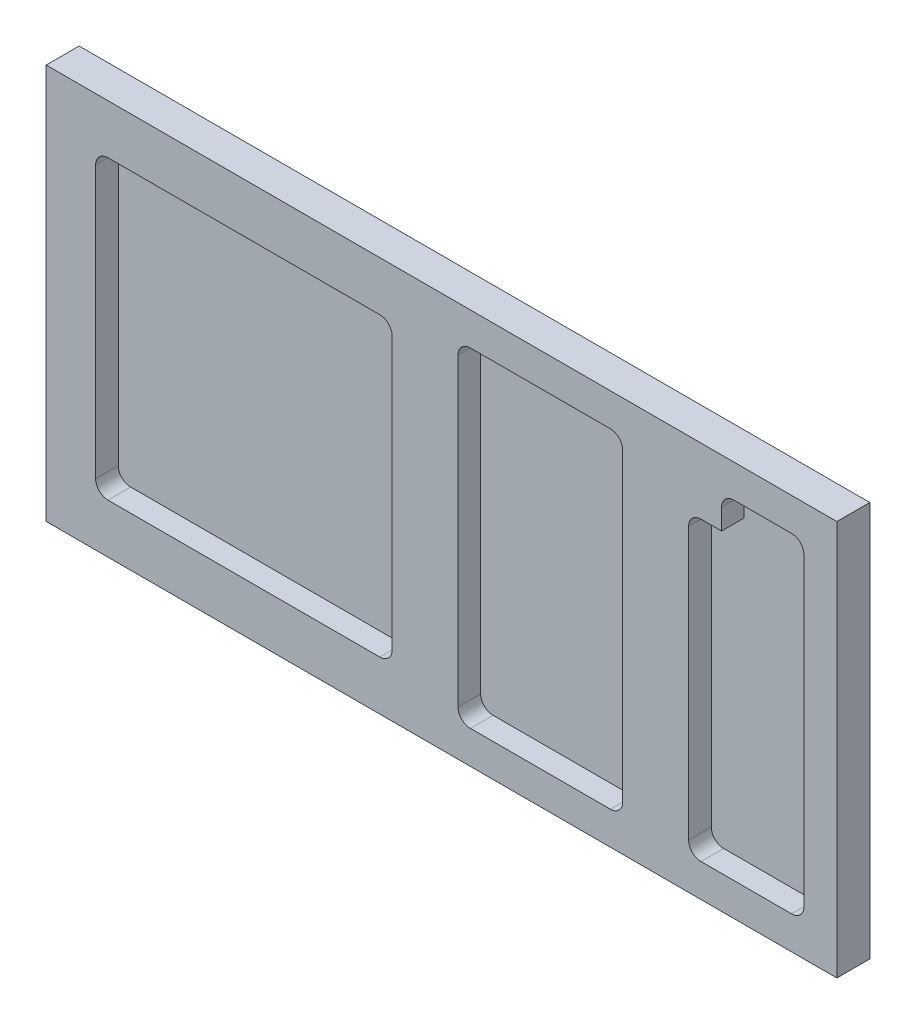
ISO-10303-21;
HEADER;
FILE_DESCRIPTION(('STEP AP214'),'2;1');
FILE_NAME('part.step','',(''),(''),'','','');
FILE_SCHEMA(('AUTOMOTIVE_DESIGN { 1 0 10303 214 1 1 1 1 }'));
ENDSEC;
DATA;
#1=APPLICATION_CONTEXT('core data for automotive mechanical design processes');
#2=APPLICATION_PROTOCOL_DEFINITION('international standard','automotive_design',2000,#1);
#3=PRODUCT_CONTEXT('',#1,'mechanical');
#4=PRODUCT('Part','Part','',(#3));
#5=PRODUCT_RELATED_PRODUCT_CATEGORY('part','',(#4));
#6=PRODUCT_DEFINITION_FORMATION('','',#4);
#7=PRODUCT_DEFINITION_CONTEXT('part definition',#1,'design');
#8=PRODUCT_DEFINITION('design','',#6,#7);
#9=PRODUCT_DEFINITION_SHAPE('','',#8);
#10=(LENGTH_UNIT() NAMED_UNIT(*) SI_UNIT(.MILLI.,.METRE.));
#11=(NAMED_UNIT(*) PLANE_ANGLE_UNIT() SI_UNIT($,.RADIAN.));
#12=(NAMED_UNIT(*) SI_UNIT($,.STERADIAN.) SOLID_ANGLE_UNIT());
#13=UNCERTAINTY_MEASURE_WITH_UNIT(LENGTH_MEASURE(1.E-05),#10,'distance_accuracy_value','');
#14=(GEOMETRIC_REPRESENTATION_CONTEXT(3) GLOBAL_UNCERTAINTY_ASSIGNED_CONTEXT((#13)) GLOBAL_UNIT_ASSIGNED_CONTEXT((#10,
#11,#12)) REPRESENTATION_CONTEXT('',''));
#15=CARTESIAN_POINT('',(0.,0.,0.));
#16=DIRECTION('',(0.,0.,1.));
#17=DIRECTION('',(1.,0.,0.));
#18=AXIS2_PLACEMENT_3D('',#15,#16,#17);
#19=CARTESIAN_POINT('',(152.4,76.2,12.7));
#20=DIRECTION('',(-1.,0.,0.));
#21=DIRECTION('',(0.,-1.,0.));
#22=AXIS2_PLACEMENT_3D('',#19,#20,#21);
#23=PLANE('',#22);
#24=DIRECTION('',(0.,1.,0.));
#25=VECTOR('',#24,1.);
#26=CARTESIAN_POINT('',(152.4,76.2,0.));
#27=LINE('',#26,#25);
#28=CARTESIAN_POINT('',(152.4,-76.2,0.));
#29=VERTEX_POINT('',#28);
#30=CARTESIAN_POINT('',(152.4,76.2,0.));
#31=VERTEX_POINT('',#30);
#32=EDGE_CURVE('E441',#29,#31,#27,.T.);
#33=ORIENTED_EDGE('',*,*,#32,.T.);
#34=DIRECTION('',(0.,0.,-1.));
#35=VECTOR('',#34,1.);
#36=CARTESIAN_POINT('',(152.4,76.2,12.7));
#37=LINE('',#36,#35);
#38=CARTESIAN_POINT('',(152.4,76.2,12.7));
#39=VERTEX_POINT('',#38);
#40=EDGE_CURVE('E11',#39,#31,#37,.T.);
#41=ORIENTED_EDGE('',*,*,#40,.F.);
#42=DIRECTION('',(0.,1.,0.));
#43=VECTOR('',#42,1.);
#44=CARTESIAN_POINT('',(152.4,76.2,12.7));
#45=LINE('',#44,#43);
#46=CARTESIAN_POINT('',(152.4,-76.2,12.7));
#47=VERTEX_POINT('',#46);
#48=EDGE_CURVE('E456',#47,#39,#45,.T.);
#49=ORIENTED_EDGE('',*,*,#48,.F.);
#50=DIRECTION('',(0.,0.,-1.));
#51=VECTOR('',#50,1.);
#52=CARTESIAN_POINT('',(152.4,-76.2,12.7));
#53=LINE('',#52,#51);
#54=EDGE_CURVE('E466',#47,#29,#53,.T.);
#55=ORIENTED_EDGE('',*,*,#54,.T.);
#56=EDGE_LOOP('',(#33,#41,#49,#55));
#57=FACE_BOUND('',#56,.T.);
#58=ADVANCED_FACE('F33',(#57),#23,.F.);
#59=CARTESIAN_POINT('',(-152.4,76.2,12.7));
#60=DIRECTION('',(0.,-1.,0.));
#61=DIRECTION('',(0.,0.,-1.));
#62=AXIS2_PLACEMENT_3D('',#59,#60,#61);
#63=PLANE('',#62);
#64=DIRECTION('',(-1.,0.,0.));
#65=VECTOR('',#64,1.);
#66=CARTESIAN_POINT('',(-152.4,76.2,0.));
#67=LINE('',#66,#65);
#68=CARTESIAN_POINT('',(-152.4,76.2,0.));
#69=VERTEX_POINT('',#68);
#70=EDGE_CURVE('E469',#31,#69,#67,.T.);
#71=ORIENTED_EDGE('',*,*,#70,.T.);
#72=DIRECTION('',(0.,0.,-1.));
#73=VECTOR('',#72,1.);
#74=CARTESIAN_POINT('',(-152.4,76.2,12.7));
#75=LINE('',#74,#73);
#76=CARTESIAN_POINT('',(-152.4,76.2,12.7));
#77=VERTEX_POINT('',#76);
#78=EDGE_CURVE('E40',#77,#69,#75,.T.);
#79=ORIENTED_EDGE('',*,*,#78,.F.);
#80=DIRECTION('',(-1.,0.,0.));
#81=VECTOR('',#80,1.);
#82=CARTESIAN_POINT('',(-152.4,76.2,12.7));
#83=LINE('',#82,#81);
#84=EDGE_CURVE('E459',#39,#77,#83,.T.);
#85=ORIENTED_EDGE('',*,*,#84,.F.);
#86=ORIENTED_EDGE('',*,*,#40,.T.);
#87=EDGE_LOOP('',(#71,#79,#85,#86));
#88=FACE_BOUND('',#87,.T.);
#89=ADVANCED_FACE('F499',(#88),#63,.F.);
#90=CARTESIAN_POINT('',(-152.4,76.2,12.7));
#91=DIRECTION('',(1.,0.,0.));
#92=DIRECTION('',(0.,1.,0.));
#93=AXIS2_PLACEMENT_3D('',#90,#91,#92);
#94=PLANE('',#93);
#95=DIRECTION('',(0.,-1.,0.));
#96=VECTOR('',#95,1.);
#97=CARTESIAN_POINT('',(-152.4,76.2,0.));
#98=LINE('',#97,#96);
#99=CARTESIAN_POINT('',(-152.4,-76.2,0.));
#100=VERTEX_POINT('',#99);
#101=EDGE_CURVE('E471',#69,#100,#98,.T.);
#102=ORIENTED_EDGE('',*,*,#101,.T.);
#103=DIRECTION('',(0.,0.,-1.));
#104=VECTOR('',#103,1.);
#105=CARTESIAN_POINT('',(-152.4,-76.2,12.7));
#106=LINE('',#105,#104);
#107=CARTESIAN_POINT('',(-152.4,-76.2,12.7));
#108=VERTEX_POINT('',#107);
#109=EDGE_CURVE('E476',#108,#100,#106,.T.);
#110=ORIENTED_EDGE('',*,*,#109,.F.);
#111=DIRECTION('',(0.,-1.,0.));
#112=VECTOR('',#111,1.);
#113=CARTESIAN_POINT('',(-152.4,76.2,12.7));
#114=LINE('',#113,#112);
#115=EDGE_CURVE('E462',#77,#108,#114,.T.);
#116=ORIENTED_EDGE('',*,*,#115,.F.);
#117=ORIENTED_EDGE('',*,*,#78,.T.);
#118=EDGE_LOOP('',(#102,#110,#116,#117));
#119=FACE_BOUND('',#118,.T.);
#120=ADVANCED_FACE('F483',(#119),#94,.F.);
#121=CARTESIAN_POINT('',(-152.4,-76.2,12.7));
#122=DIRECTION('',(0.,1.,0.));
#123=DIRECTION('',(0.,0.,1.));
#124=AXIS2_PLACEMENT_3D('',#121,#122,#123);
#125=PLANE('',#124);
#126=DIRECTION('',(1.,0.,0.));
#127=VECTOR('',#126,1.);
#128=CARTESIAN_POINT('',(-152.4,-76.2,0.));
#129=LINE('',#128,#127);
#130=EDGE_CURVE('E460',#100,#29,#129,.T.);
#131=ORIENTED_EDGE('',*,*,#130,.T.);
#132=ORIENTED_EDGE('',*,*,#54,.F.);
#133=DIRECTION('',(1.,0.,0.));
#134=VECTOR('',#133,1.);
#135=CARTESIAN_POINT('',(-152.4,-76.2,12.7));
#136=LINE('',#135,#134);
#137=EDGE_CURVE('E464',#108,#47,#136,.T.);
#138=ORIENTED_EDGE('',*,*,#137,.F.);
#139=ORIENTED_EDGE('',*,*,#109,.T.);
#140=EDGE_LOOP('',(#131,#132,#138,#139));
#141=FACE_BOUND('',#140,.T.);
#142=ADVANCED_FACE('F492',(#141),#125,.F.);
#143=CARTESIAN_POINT('',(0.,0.,12.7));
#144=DIRECTION('',(0.,0.,1.));
#145=DIRECTION('',(1.,0.,0.));
#146=AXIS2_PLACEMENT_3D('',#143,#144,#145);
#147=PLANE('',#146);
#148=CARTESIAN_POINT('',(11.1125000000001,-58.7375,12.7));
#149=DIRECTION('',(0.,0.,1.));
#150=DIRECTION('',(1.,0.,0.));
#151=AXIS2_PLACEMENT_3D('',#148,#149,#150);
#152=CIRCLE('',#151,4.7625);
#153=CARTESIAN_POINT('',(6.35000000000008,-58.7375,12.7));
#154=VERTEX_POINT('',#153);
#155=CARTESIAN_POINT('',(11.1125000000001,-63.5,12.7));
#156=VERTEX_POINT('',#155);
#157=EDGE_CURVE('E47',#154,#156,#152,.T.);
#158=ORIENTED_EDGE('',*,*,#157,.F.);
#159=DIRECTION('',(0.,-1.,0.));
#160=VECTOR('',#159,1.);
#161=CARTESIAN_POINT('',(6.35000000000006,58.7375,12.7));
#162=LINE('',#161,#160);
#163=CARTESIAN_POINT('',(6.35000000000006,58.7375,12.7));
#164=VERTEX_POINT('',#163);
#165=EDGE_CURVE('E257',#164,#154,#162,.T.);
#166=ORIENTED_EDGE('',*,*,#165,.F.);
#167=CARTESIAN_POINT('',(11.1125000000001,58.7375,12.7));
#168=DIRECTION('',(0.,0.,1.));
#169=DIRECTION('',(1.,0.,0.));
#170=AXIS2_PLACEMENT_3D('',#167,#168,#169);
#171=CIRCLE('',#170,4.7625);
#172=CARTESIAN_POINT('',(11.1125000000001,63.5,12.7));
#173=VERTEX_POINT('',#172);
#174=EDGE_CURVE('E260',#173,#164,#171,.T.);
#175=ORIENTED_EDGE('',*,*,#174,.F.);
#176=DIRECTION('',(-1.,0.,0.));
#177=VECTOR('',#176,1.);
#178=CARTESIAN_POINT('',(11.1125000000001,63.5,12.7));
#179=LINE('',#178,#177);
#180=CARTESIAN_POINT('',(65.0875,63.5,12.7));
#181=VERTEX_POINT('',#180);
#182=EDGE_CURVE('E288',#181,#173,#179,.T.);
#183=ORIENTED_EDGE('',*,*,#182,.F.);
#184=CARTESIAN_POINT('',(65.0875000000001,58.7375,12.7));
#185=DIRECTION('',(0.,0.,1.));
#186=DIRECTION('',(-1.,0.,0.));
#187=AXIS2_PLACEMENT_3D('',#184,#185,#186);
#188=CIRCLE('',#187,4.7625);
#189=CARTESIAN_POINT('',(69.8500000000001,58.7375,12.7));
#190=VERTEX_POINT('',#189);
#191=EDGE_CURVE('E285',#190,#181,#188,.T.);
#192=ORIENTED_EDGE('',*,*,#191,.F.);
#193=DIRECTION('',(0.,1.,0.));
#194=VECTOR('',#193,1.);
#195=CARTESIAN_POINT('',(69.8500000000001,58.7375,12.7));
#196=LINE('',#195,#194);
#197=CARTESIAN_POINT('',(69.8500000000001,-58.7375,12.7));
#198=VERTEX_POINT('',#197);
#199=EDGE_CURVE('E282',#198,#190,#196,.T.);
#200=ORIENTED_EDGE('',*,*,#199,.F.);
#201=CARTESIAN_POINT('',(65.0875000000001,-58.7375,12.7));
#202=DIRECTION('',(0.,0.,1.));
#203=DIRECTION('',(1.,0.,0.));
#204=AXIS2_PLACEMENT_3D('',#201,#202,#203);
#205=CIRCLE('',#204,4.7625);
#206=CARTESIAN_POINT('',(65.0875,-63.5,12.7));
#207=VERTEX_POINT('',#206);
#208=EDGE_CURVE('E279',#207,#198,#205,.T.);
#209=ORIENTED_EDGE('',*,*,#208,.F.);
#210=DIRECTION('',(1.,0.,0.));
#211=VECTOR('',#210,1.);
#212=CARTESIAN_POINT('',(11.1125000000001,-63.5,12.7));
#213=LINE('',#212,#211);
#214=EDGE_CURVE('E277',#156,#207,#213,.T.);
#215=ORIENTED_EDGE('',*,*,#214,.F.);
#216=EDGE_LOOP('',(#158,#166,#175,#183,#192,#200,#209,#215));
#217=FACE_BOUND('',#216,.T.);
#218=DIRECTION('',(0.,1.,0.));
#219=VECTOR('',#218,1.);
#220=CARTESIAN_POINT('',(139.7,50.8,12.7));
#221=LINE('',#220,#219);
#222=CARTESIAN_POINT('',(139.7,-58.7375,12.7));
#223=VERTEX_POINT('',#222);
#224=CARTESIAN_POINT('',(139.7,58.7375,12.7));
#225=VERTEX_POINT('',#224);
#226=EDGE_CURVE('E311',#223,#225,#221,.T.);
#227=ORIENTED_EDGE('',*,*,#226,.F.);
#228=CARTESIAN_POINT('',(134.9375,-58.7375,12.7));
#229=DIRECTION('',(0.,0.,1.));
#230=DIRECTION('',(1.,0.,0.));
#231=AXIS2_PLACEMENT_3D('',#228,#229,#230);
#232=CIRCLE('',#231,4.7625);
#233=CARTESIAN_POINT('',(134.9375,-63.5,12.7));
#234=VERTEX_POINT('',#233);
#235=EDGE_CURVE('E366',#234,#223,#232,.T.);
#236=ORIENTED_EDGE('',*,*,#235,.F.);
#237=DIRECTION('',(1.,0.,0.));
#238=VECTOR('',#237,1.);
#239=CARTESIAN_POINT('',(100.0125,-63.5,12.7));
#240=LINE('',#239,#238);
#241=CARTESIAN_POINT('',(100.0125,-63.5,12.7));
#242=VERTEX_POINT('',#241);
#243=EDGE_CURVE('E363',#242,#234,#240,.T.);
#244=ORIENTED_EDGE('',*,*,#243,.F.);
#245=CARTESIAN_POINT('',(100.0125,-58.7375,12.7));
#246=DIRECTION('',(0.,0.,1.));
#247=DIRECTION('',(1.,0.,0.));
#248=AXIS2_PLACEMENT_3D('',#245,#246,#247);
#249=CIRCLE('',#248,4.7625);
#250=CARTESIAN_POINT('',(95.2500000000001,-58.7375,12.7));
#251=VERTEX_POINT('',#250);
#252=EDGE_CURVE('E360',#251,#242,#249,.T.);
#253=ORIENTED_EDGE('',*,*,#252,.F.);
#254=DIRECTION('',(0.,-1.,0.));
#255=VECTOR('',#254,1.);
#256=CARTESIAN_POINT('',(95.2500000000001,46.0375,12.7));
#257=LINE('',#256,#255);
#258=CARTESIAN_POINT('',(95.2500000000001,46.0375,12.7));
#259=VERTEX_POINT('',#258);
#260=EDGE_CURVE('E357',#259,#251,#257,.T.);
#261=ORIENTED_EDGE('',*,*,#260,.F.);
#262=CARTESIAN_POINT('',(100.0125,46.0375,12.7));
#263=DIRECTION('',(0.,0.,1.));
#264=DIRECTION('',(1.,0.,0.));
#265=AXIS2_PLACEMENT_3D('',#262,#263,#264);
#266=CIRCLE('',#265,4.7625);
#267=CARTESIAN_POINT('',(100.0125,50.8,12.7));
#268=VERTEX_POINT('',#267);
#269=EDGE_CURVE('E354',#268,#259,#266,.T.);
#270=ORIENTED_EDGE('',*,*,#269,.F.);
#271=DIRECTION('',(-1.,0.,0.));
#272=VECTOR('',#271,1.);
#273=CARTESIAN_POINT('',(100.0125,50.8,12.7));
#274=LINE('',#273,#272);
#275=CARTESIAN_POINT('',(107.95,50.8,12.7));
#276=VERTEX_POINT('',#275);
#277=EDGE_CURVE('E351',#276,#268,#274,.T.);
#278=ORIENTED_EDGE('',*,*,#277,.F.);
#279=DIRECTION('',(0.,-1.,0.));
#280=VECTOR('',#279,1.);
#281=CARTESIAN_POINT('',(107.95,50.8,12.7));
#282=LINE('',#281,#280);
#283=CARTESIAN_POINT('',(107.95,58.7375,12.7));
#284=VERTEX_POINT('',#283);
#285=EDGE_CURVE('E348',#284,#276,#282,.T.);
#286=ORIENTED_EDGE('',*,*,#285,.F.);
#287=CARTESIAN_POINT('',(112.7125,58.7375,12.7));
#288=DIRECTION('',(0.,0.,1.));
#289=DIRECTION('',(1.,0.,0.));
#290=AXIS2_PLACEMENT_3D('',#287,#288,#289);
#291=CIRCLE('',#290,4.7625);
#292=CARTESIAN_POINT('',(112.7125,63.5,12.7));
#293=VERTEX_POINT('',#292);
#294=EDGE_CURVE('E345',#293,#284,#291,.T.);
#295=ORIENTED_EDGE('',*,*,#294,.F.);
#296=DIRECTION('',(-1.,0.,0.));
#297=VECTOR('',#296,1.);
#298=CARTESIAN_POINT('',(134.9375,63.5,12.7));
#299=LINE('',#298,#297);
#300=CARTESIAN_POINT('',(134.9375,63.5,12.7));
#301=VERTEX_POINT('',#300);
#302=EDGE_CURVE('E342',#301,#293,#299,.T.);
#303=ORIENTED_EDGE('',*,*,#302,.F.);
#304=CARTESIAN_POINT('',(134.9375,58.7375,12.7));
#305=DIRECTION('',(0.,0.,1.));
#306=DIRECTION('',(1.,0.,0.));
#307=AXIS2_PLACEMENT_3D('',#304,#305,#306);
#308=CIRCLE('',#307,4.7625);
#309=EDGE_CURVE('E295',#225,#301,#308,.T.);
#310=ORIENTED_EDGE('',*,*,#309,.F.);
#311=EDGE_LOOP('',(#227,#236,#244,#253,#261,#270,#278,#286,#295,#303,#310));
#312=FACE_BOUND('',#311,.T.);
#313=CARTESIAN_POINT('',(-128.5875,-52.3875,12.7));
#314=DIRECTION('',(0.,0.,1.));
#315=DIRECTION('',(1.,0.,0.));
#316=AXIS2_PLACEMENT_3D('',#313,#314,#315);
#317=CIRCLE('',#316,4.7625);
#318=CARTESIAN_POINT('',(-133.35,-52.3875,12.7));
#319=VERTEX_POINT('',#318);
#320=CARTESIAN_POINT('',(-128.5875,-57.15,12.7));
#321=VERTEX_POINT('',#320);
#322=EDGE_CURVE('E372',#319,#321,#317,.T.);
#323=ORIENTED_EDGE('',*,*,#322,.F.);
#324=DIRECTION('',(0.,-1.,0.));
#325=VECTOR('',#324,1.);
#326=CARTESIAN_POINT('',(-133.35,52.3875,12.7));
#327=LINE('',#326,#325);
#328=CARTESIAN_POINT('',(-133.35,52.3875,12.7));
#329=VERTEX_POINT('',#328);
#330=EDGE_CURVE('E396',#329,#319,#327,.T.);
#331=ORIENTED_EDGE('',*,*,#330,.F.);
#332=CARTESIAN_POINT('',(-128.5875,52.3875,12.7));
#333=DIRECTION('',(0.,0.,1.));
#334=DIRECTION('',(1.,0.,0.));
#335=AXIS2_PLACEMENT_3D('',#332,#333,#334);
#336=CIRCLE('',#335,4.7625);
#337=CARTESIAN_POINT('',(-128.5875,57.15,12.7));
#338=VERTEX_POINT('',#337);
#339=EDGE_CURVE('E434',#338,#329,#336,.T.);
#340=ORIENTED_EDGE('',*,*,#339,.F.);
#341=DIRECTION('',(-1.,0.,0.));
#342=VECTOR('',#341,1.);
#343=CARTESIAN_POINT('',(-128.5875,57.15,12.7));
#344=LINE('',#343,#342);
#345=CARTESIAN_POINT('',(-23.8125,57.15,12.7));
#346=VERTEX_POINT('',#345);
#347=EDGE_CURVE('E431',#346,#338,#344,.T.);
#348=ORIENTED_EDGE('',*,*,#347,.F.);
#349=CARTESIAN_POINT('',(-23.8124999999999,52.3875,12.7));
#350=DIRECTION('',(0.,0.,1.));
#351=DIRECTION('',(-1.,0.,0.));
#352=AXIS2_PLACEMENT_3D('',#349,#350,#351);
#353=CIRCLE('',#352,4.7625);
#354=CARTESIAN_POINT('',(-19.0499999999999,52.3875,12.7));
#355=VERTEX_POINT('',#354);
#356=EDGE_CURVE('E428',#355,#346,#353,.T.);
#357=ORIENTED_EDGE('',*,*,#356,.F.);
#358=DIRECTION('',(0.,1.,0.));
#359=VECTOR('',#358,1.);
#360=CARTESIAN_POINT('',(-19.0499999999999,52.3875,12.7));
#361=LINE('',#360,#359);
#362=CARTESIAN_POINT('',(-19.0499999999999,-52.3875,12.7));
#363=VERTEX_POINT('',#362);
#364=EDGE_CURVE('E425',#363,#355,#361,.T.);
#365=ORIENTED_EDGE('',*,*,#364,.F.);
#366=CARTESIAN_POINT('',(-23.8124999999999,-52.3875,12.7));
#367=DIRECTION('',(0.,0.,1.));
#368=DIRECTION('',(1.,0.,0.));
#369=AXIS2_PLACEMENT_3D('',#366,#367,#368);
#370=CIRCLE('',#369,4.7625);
#371=CARTESIAN_POINT('',(-23.8125,-57.15,12.7));
#372=VERTEX_POINT('',#371);
#373=EDGE_CURVE('E422',#372,#363,#370,.T.);
#374=ORIENTED_EDGE('',*,*,#373,.F.);
#375=DIRECTION('',(1.,0.,0.));
#376=VECTOR('',#375,1.);
#377=CARTESIAN_POINT('',(-128.5875,-57.15,12.7));
#378=LINE('',#377,#376);
#379=EDGE_CURVE('E419',#321,#372,#378,.T.);
#380=ORIENTED_EDGE('',*,*,#379,.F.);
#381=EDGE_LOOP('',(#323,#331,#340,#348,#357,#365,#374,#380));
#382=FACE_BOUND('',#381,.T.);
#383=ORIENTED_EDGE('',*,*,#48,.T.);
#384=ORIENTED_EDGE('',*,*,#84,.T.);
#385=ORIENTED_EDGE('',*,*,#115,.T.);
#386=ORIENTED_EDGE('',*,*,#137,.T.);
#387=EDGE_LOOP('',(#383,#384,#385,#386));
#388=FACE_BOUND('',#387,.T.);
#389=ADVANCED_FACE('F498',(#217,#312,#382,#388),#147,.T.);
#390=CARTESIAN_POINT('',(0.,0.,0.));
#391=DIRECTION('',(0.,0.,1.));
#392=DIRECTION('',(1.,0.,0.));
#393=AXIS2_PLACEMENT_3D('',#390,#391,#392);
#394=PLANE('',#393);
#395=ORIENTED_EDGE('',*,*,#32,.F.);
#396=ORIENTED_EDGE('',*,*,#130,.F.);
#397=ORIENTED_EDGE('',*,*,#101,.F.);
#398=ORIENTED_EDGE('',*,*,#70,.F.);
#399=EDGE_LOOP('',(#395,#396,#397,#398));
#400=FACE_BOUND('',#399,.T.);
#401=ADVANCED_FACE('F489',(#400),#394,.F.);
#402=CARTESIAN_POINT('',(-128.5875,-52.3875,3.96748));
#403=DIRECTION('',(0.,0.,1.));
#404=DIRECTION('',(1.,0.,0.));
#405=AXIS2_PLACEMENT_3D('',#402,#403,#404);
#406=CYLINDRICAL_SURFACE('',#405,4.7625);
#407=ORIENTED_EDGE('',*,*,#322,.T.);
#408=DIRECTION('',(0.,0.,1.));
#409=VECTOR('',#408,1.);
#410=CARTESIAN_POINT('',(-128.5875,-57.15,3.96748));
#411=LINE('',#410,#409);
#412=CARTESIAN_POINT('',(-128.5875,-57.15,3.96748));
#413=VERTEX_POINT('',#412);
#414=EDGE_CURVE('E417',#413,#321,#411,.T.);
#415=ORIENTED_EDGE('',*,*,#414,.F.);
#416=CARTESIAN_POINT('',(-128.5875,-52.3875,3.96748));
#417=DIRECTION('',(0.,0.,1.));
#418=DIRECTION('',(1.,0.,0.));
#419=AXIS2_PLACEMENT_3D('',#416,#417,#418);
#420=CIRCLE('',#419,4.7625);
#421=CARTESIAN_POINT('',(-133.35,-52.3875,3.96748));
#422=VERTEX_POINT('',#421);
#423=EDGE_CURVE('E392',#422,#413,#420,.T.);
#424=ORIENTED_EDGE('',*,*,#423,.F.);
#425=DIRECTION('',(0.,0.,1.));
#426=VECTOR('',#425,1.);
#427=CARTESIAN_POINT('',(-133.35,-52.3875,3.96748));
#428=LINE('',#427,#426);
#429=EDGE_CURVE('E439',#422,#319,#428,.T.);
#430=ORIENTED_EDGE('',*,*,#429,.T.);
#431=EDGE_LOOP('',(#407,#415,#424,#430));
#432=FACE_BOUND('',#431,.T.);
#433=ADVANCED_FACE('F511',(#432),#406,.F.);
#434=CARTESIAN_POINT('',(-133.35,52.3875,3.96748));
#435=DIRECTION('',(-1.,0.,0.));
#436=DIRECTION('',(0.,-1.,0.));
#437=AXIS2_PLACEMENT_3D('',#434,#435,#436);
#438=PLANE('',#437);
#439=ORIENTED_EDGE('',*,*,#330,.T.);
#440=ORIENTED_EDGE('',*,*,#429,.F.);
#441=DIRECTION('',(0.,-1.,0.));
#442=VECTOR('',#441,1.);
#443=CARTESIAN_POINT('',(-133.35,52.3875,3.96748));
#444=LINE('',#443,#442);
#445=CARTESIAN_POINT('',(-133.35,52.3875,3.96748));
#446=VERTEX_POINT('',#445);
#447=EDGE_CURVE('E414',#446,#422,#444,.T.);
#448=ORIENTED_EDGE('',*,*,#447,.F.);
#449=DIRECTION('',(0.,0.,1.));
#450=VECTOR('',#449,1.);
#451=CARTESIAN_POINT('',(-133.35,52.3875,3.96748));
#452=LINE('',#451,#450);
#453=EDGE_CURVE('E442',#446,#329,#452,.T.);
#454=ORIENTED_EDGE('',*,*,#453,.T.);
#455=EDGE_LOOP('',(#439,#440,#448,#454));
#456=FACE_BOUND('',#455,.T.);
#457=ADVANCED_FACE('F517',(#456),#438,.F.);
#458=CARTESIAN_POINT('',(-128.5875,52.3875,3.96748));
#459=DIRECTION('',(0.,0.,1.));
#460=DIRECTION('',(1.,0.,0.));
#461=AXIS2_PLACEMENT_3D('',#458,#459,#460);
#462=CYLINDRICAL_SURFACE('',#461,4.7625);
#463=ORIENTED_EDGE('',*,*,#339,.T.);
#464=ORIENTED_EDGE('',*,*,#453,.F.);
#465=CARTESIAN_POINT('',(-128.5875,52.3875,3.96748));
#466=DIRECTION('',(0.,0.,1.));
#467=DIRECTION('',(1.,0.,0.));
#468=AXIS2_PLACEMENT_3D('',#465,#466,#467);
#469=CIRCLE('',#468,4.7625);
#470=CARTESIAN_POINT('',(-128.5875,57.15,3.96748));
#471=VERTEX_POINT('',#470);
#472=EDGE_CURVE('E411',#471,#446,#469,.T.);
#473=ORIENTED_EDGE('',*,*,#472,.F.);
#474=DIRECTION('',(0.,0.,1.));
#475=VECTOR('',#474,1.);
#476=CARTESIAN_POINT('',(-128.5875,57.15,3.96748));
#477=LINE('',#476,#475);
#478=EDGE_CURVE('E444',#471,#338,#477,.T.);
#479=ORIENTED_EDGE('',*,*,#478,.T.);
#480=EDGE_LOOP('',(#463,#464,#473,#479));
#481=FACE_BOUND('',#480,.T.);
#482=ADVANCED_FACE('F539',(#481),#462,.F.);
#483=CARTESIAN_POINT('',(-128.5875,57.15,3.96748));
#484=DIRECTION('',(0.,1.,0.));
#485=DIRECTION('',(0.,0.,1.));
#486=AXIS2_PLACEMENT_3D('',#483,#484,#485);
#487=PLANE('',#486);
#488=ORIENTED_EDGE('',*,*,#347,.T.);
#489=ORIENTED_EDGE('',*,*,#478,.F.);
#490=DIRECTION('',(-1.,0.,0.));
#491=VECTOR('',#490,1.);
#492=CARTESIAN_POINT('',(-128.5875,57.15,3.96748));
#493=LINE('',#492,#491);
#494=CARTESIAN_POINT('',(-23.8125,57.15,3.96748));
#495=VERTEX_POINT('',#494);
#496=EDGE_CURVE('E408',#495,#471,#493,.T.);
#497=ORIENTED_EDGE('',*,*,#496,.F.);
#498=DIRECTION('',(0.,0.,1.));
#499=VECTOR('',#498,1.);
#500=CARTESIAN_POINT('',(-23.8125,57.15,3.96748));
#501=LINE('',#500,#499);
#502=EDGE_CURVE('E446',#495,#346,#501,.T.);
#503=ORIENTED_EDGE('',*,*,#502,.T.);
#504=EDGE_LOOP('',(#488,#489,#497,#503));
#505=FACE_BOUND('',#504,.T.);
#506=ADVANCED_FACE('F535',(#505),#487,.F.);
#507=CARTESIAN_POINT('',(-23.8124999999999,52.3875,3.96748));
#508=DIRECTION('',(0.,0.,1.));
#509=DIRECTION('',(1.,0.,0.));
#510=AXIS2_PLACEMENT_3D('',#507,#508,#509);
#511=CYLINDRICAL_SURFACE('',#510,4.7625);
#512=ORIENTED_EDGE('',*,*,#356,.T.);
#513=ORIENTED_EDGE('',*,*,#502,.F.);
#514=CARTESIAN_POINT('',(-23.8124999999999,52.3875,3.96748));
#515=DIRECTION('',(0.,0.,1.));
#516=DIRECTION('',(-1.,0.,0.));
#517=AXIS2_PLACEMENT_3D('',#514,#515,#516);
#518=CIRCLE('',#517,4.7625);
#519=CARTESIAN_POINT('',(-19.0499999999999,52.3875,3.96748));
#520=VERTEX_POINT('',#519);
#521=EDGE_CURVE('E405',#520,#495,#518,.T.);
#522=ORIENTED_EDGE('',*,*,#521,.F.);
#523=DIRECTION('',(0.,0.,1.));
#524=VECTOR('',#523,1.);
#525=CARTESIAN_POINT('',(-19.0499999999999,52.3875,3.96748));
#526=LINE('',#525,#524);
#527=EDGE_CURVE('E448',#520,#355,#526,.T.);
#528=ORIENTED_EDGE('',*,*,#527,.T.);
#529=EDGE_LOOP('',(#512,#513,#522,#528));
#530=FACE_BOUND('',#529,.T.);
#531=ADVANCED_FACE('F531',(#530),#511,.F.);
#532=CARTESIAN_POINT('',(-19.0499999999999,52.3875,3.96748));
#533=DIRECTION('',(1.,0.,0.));
#534=DIRECTION('',(0.,1.,0.));
#535=AXIS2_PLACEMENT_3D('',#532,#533,#534);
#536=PLANE('',#535);
#537=ORIENTED_EDGE('',*,*,#364,.T.);
#538=ORIENTED_EDGE('',*,*,#527,.F.);
#539=DIRECTION('',(0.,1.,0.));
#540=VECTOR('',#539,1.);
#541=CARTESIAN_POINT('',(-19.0499999999999,52.3875,3.96748));
#542=LINE('',#541,#540);
#543=CARTESIAN_POINT('',(-19.0499999999999,-52.3875,3.96748));
#544=VERTEX_POINT('',#543);
#545=EDGE_CURVE('E402',#544,#520,#542,.T.);
#546=ORIENTED_EDGE('',*,*,#545,.F.);
#547=DIRECTION('',(0.,0.,1.));
#548=VECTOR('',#547,1.);
#549=CARTESIAN_POINT('',(-19.0499999999999,-52.3875,3.96748));
#550=LINE('',#549,#548);
#551=EDGE_CURVE('E450',#544,#363,#550,.T.);
#552=ORIENTED_EDGE('',*,*,#551,.T.);
#553=EDGE_LOOP('',(#537,#538,#546,#552));
#554=FACE_BOUND('',#553,.T.);
#555=ADVANCED_FACE('F527',(#554),#536,.F.);
#556=CARTESIAN_POINT('',(-23.8124999999999,-52.3875,3.96748));
#557=DIRECTION('',(0.,0.,1.));
#558=DIRECTION('',(1.,0.,0.));
#559=AXIS2_PLACEMENT_3D('',#556,#557,#558);
#560=CYLINDRICAL_SURFACE('',#559,4.7625);
#561=ORIENTED_EDGE('',*,*,#373,.T.);
#562=ORIENTED_EDGE('',*,*,#551,.F.);
#563=CARTESIAN_POINT('',(-23.8124999999999,-52.3875,3.96748));
#564=DIRECTION('',(0.,0.,1.));
#565=DIRECTION('',(1.,0.,0.));
#566=AXIS2_PLACEMENT_3D('',#563,#564,#565);
#567=CIRCLE('',#566,4.7625);
#568=CARTESIAN_POINT('',(-23.8125,-57.15,3.96748));
#569=VERTEX_POINT('',#568);
#570=EDGE_CURVE('E399',#569,#544,#567,.T.);
#571=ORIENTED_EDGE('',*,*,#570,.F.);
#572=DIRECTION('',(0.,0.,1.));
#573=VECTOR('',#572,1.);
#574=CARTESIAN_POINT('',(-23.8125,-57.15,3.96748));
#575=LINE('',#574,#573);
#576=EDGE_CURVE('E452',#569,#372,#575,.T.);
#577=ORIENTED_EDGE('',*,*,#576,.T.);
#578=EDGE_LOOP('',(#561,#562,#571,#577));
#579=FACE_BOUND('',#578,.T.);
#580=ADVANCED_FACE('F523',(#579),#560,.F.);
#581=CARTESIAN_POINT('',(-128.5875,-57.15,3.96748));
#582=DIRECTION('',(0.,-1.,0.));
#583=DIRECTION('',(0.,0.,-1.));
#584=AXIS2_PLACEMENT_3D('',#581,#582,#583);
#585=PLANE('',#584);
#586=ORIENTED_EDGE('',*,*,#379,.T.);
#587=ORIENTED_EDGE('',*,*,#576,.F.);
#588=DIRECTION('',(1.,0.,0.));
#589=VECTOR('',#588,1.);
#590=CARTESIAN_POINT('',(-128.5875,-57.15,3.96748));
#591=LINE('',#590,#589);
#592=EDGE_CURVE('E395',#413,#569,#591,.T.);
#593=ORIENTED_EDGE('',*,*,#592,.F.);
#594=ORIENTED_EDGE('',*,*,#414,.T.);
#595=EDGE_LOOP('',(#586,#587,#593,#594));
#596=FACE_BOUND('',#595,.T.);
#597=ADVANCED_FACE('F519',(#596),#585,.F.);
#598=CARTESIAN_POINT('',(-128.5875,-52.3875,3.96748));
#599=DIRECTION('',(0.,0.,1.));
#600=DIRECTION('',(1.,0.,0.));
#601=AXIS2_PLACEMENT_3D('',#598,#599,#600);
#602=PLANE('',#601);
#603=ORIENTED_EDGE('',*,*,#423,.T.);
#604=ORIENTED_EDGE('',*,*,#592,.T.);
#605=ORIENTED_EDGE('',*,*,#570,.T.);
#606=ORIENTED_EDGE('',*,*,#545,.T.);
#607=ORIENTED_EDGE('',*,*,#521,.T.);
#608=ORIENTED_EDGE('',*,*,#496,.T.);
#609=ORIENTED_EDGE('',*,*,#472,.T.);
#610=ORIENTED_EDGE('',*,*,#447,.T.);
#611=EDGE_LOOP('',(#603,#604,#605,#606,#607,#608,#609,#610));
#612=FACE_BOUND('',#611,.T.);
#613=ADVANCED_FACE('F522',(#612),#602,.T.);
#614=CARTESIAN_POINT('',(139.7,50.8,3.96748));
#615=DIRECTION('',(1.,0.,0.));
#616=DIRECTION('',(0.,1.,0.));
#617=AXIS2_PLACEMENT_3D('',#614,#615,#616);
#618=PLANE('',#617);
#619=ORIENTED_EDGE('',*,*,#226,.T.);
#620=DIRECTION('',(0.,0.,1.));
#621=VECTOR('',#620,1.);
#622=CARTESIAN_POINT('',(139.7,58.7375,3.96748));
#623=LINE('',#622,#621);
#624=CARTESIAN_POINT('',(139.7,58.7375,3.96748));
#625=VERTEX_POINT('',#624);
#626=EDGE_CURVE('E55',#625,#225,#623,.T.);
#627=ORIENTED_EDGE('',*,*,#626,.F.);
#628=DIRECTION('',(0.,1.,0.));
#629=VECTOR('',#628,1.);
#630=CARTESIAN_POINT('',(139.7,50.8,3.96748));
#631=LINE('',#630,#629);
#632=CARTESIAN_POINT('',(139.7,-58.7375,3.96748));
#633=VERTEX_POINT('',#632);
#634=EDGE_CURVE('E307',#633,#625,#631,.T.);
#635=ORIENTED_EDGE('',*,*,#634,.F.);
#636=DIRECTION('',(0.,0.,1.));
#637=VECTOR('',#636,1.);
#638=CARTESIAN_POINT('',(139.7,-58.7375,3.96748));
#639=LINE('',#638,#637);
#640=EDGE_CURVE('E370',#633,#223,#639,.T.);
#641=ORIENTED_EDGE('',*,*,#640,.T.);
#642=EDGE_LOOP('',(#619,#627,#635,#641));
#643=FACE_BOUND('',#642,.T.);
#644=ADVANCED_FACE('F549',(#643),#618,.F.);
#645=CARTESIAN_POINT('',(134.9375,-58.7375,3.96748));
#646=DIRECTION('',(0.,0.,1.));
#647=DIRECTION('',(1.,0.,0.));
#648=AXIS2_PLACEMENT_3D('',#645,#646,#647);
#649=CYLINDRICAL_SURFACE('',#648,4.7625);
#650=ORIENTED_EDGE('',*,*,#235,.T.);
#651=ORIENTED_EDGE('',*,*,#640,.F.);
#652=CARTESIAN_POINT('',(134.9375,-58.7375,3.96748));
#653=DIRECTION('',(0.,0.,1.));
#654=DIRECTION('',(1.,0.,0.));
#655=AXIS2_PLACEMENT_3D('',#652,#653,#654);
#656=CIRCLE('',#655,4.7625);
#657=CARTESIAN_POINT('',(134.9375,-63.5,3.96748));
#658=VERTEX_POINT('',#657);
#659=EDGE_CURVE('E338',#658,#633,#656,.T.);
#660=ORIENTED_EDGE('',*,*,#659,.F.);
#661=DIRECTION('',(0.,0.,1.));
#662=VECTOR('',#661,1.);
#663=CARTESIAN_POINT('',(134.9375,-63.5,3.96748));
#664=LINE('',#663,#662);
#665=EDGE_CURVE('E373',#658,#234,#664,.T.);
#666=ORIENTED_EDGE('',*,*,#665,.T.);
#667=EDGE_LOOP('',(#650,#651,#660,#666));
#668=FACE_BOUND('',#667,.T.);
#669=ADVANCED_FACE('F586',(#668),#649,.F.);
#670=CARTESIAN_POINT('',(100.0125,-63.5,3.96748));
#671=DIRECTION('',(0.,-1.,0.));
#672=DIRECTION('',(0.,0.,-1.));
#673=AXIS2_PLACEMENT_3D('',#670,#671,#672);
#674=PLANE('',#673);
#675=ORIENTED_EDGE('',*,*,#243,.T.);
#676=ORIENTED_EDGE('',*,*,#665,.F.);
#677=DIRECTION('',(1.,0.,0.));
#678=VECTOR('',#677,1.);
#679=CARTESIAN_POINT('',(100.0125,-63.5,3.96748));
#680=LINE('',#679,#678);
#681=CARTESIAN_POINT('',(100.0125,-63.5,3.96748));
#682=VERTEX_POINT('',#681);
#683=EDGE_CURVE('E335',#682,#658,#680,.T.);
#684=ORIENTED_EDGE('',*,*,#683,.F.);
#685=DIRECTION('',(0.,0.,1.));
#686=VECTOR('',#685,1.);
#687=CARTESIAN_POINT('',(100.0125,-63.5,3.96748));
#688=LINE('',#687,#686);
#689=EDGE_CURVE('E375',#682,#242,#688,.T.);
#690=ORIENTED_EDGE('',*,*,#689,.T.);
#691=EDGE_LOOP('',(#675,#676,#684,#690));
#692=FACE_BOUND('',#691,.T.);
#693=ADVANCED_FACE('F582',(#692),#674,.F.);
#694=CARTESIAN_POINT('',(100.0125,-58.7375,3.96748));
#695=DIRECTION('',(0.,0.,1.));
#696=DIRECTION('',(1.,0.,0.));
#697=AXIS2_PLACEMENT_3D('',#694,#695,#696);
#698=CYLINDRICAL_SURFACE('',#697,4.7625);
#699=ORIENTED_EDGE('',*,*,#252,.T.);
#700=ORIENTED_EDGE('',*,*,#689,.F.);
#701=CARTESIAN_POINT('',(100.0125,-58.7375,3.96748));
#702=DIRECTION('',(0.,0.,1.));
#703=DIRECTION('',(1.,0.,0.));
#704=AXIS2_PLACEMENT_3D('',#701,#702,#703);
#705=CIRCLE('',#704,4.7625);
#706=CARTESIAN_POINT('',(95.2500000000001,-58.7375,3.96748));
#707=VERTEX_POINT('',#706);
#708=EDGE_CURVE('E332',#707,#682,#705,.T.);
#709=ORIENTED_EDGE('',*,*,#708,.F.);
#710=DIRECTION('',(0.,0.,1.));
#711=VECTOR('',#710,1.);
#712=CARTESIAN_POINT('',(95.2500000000001,-58.7375,3.96748));
#713=LINE('',#712,#711);
#714=EDGE_CURVE('E377',#707,#251,#713,.T.);
#715=ORIENTED_EDGE('',*,*,#714,.T.);
#716=EDGE_LOOP('',(#699,#700,#709,#715));
#717=FACE_BOUND('',#716,.T.);
#718=ADVANCED_FACE('F578',(#717),#698,.F.);
#719=CARTESIAN_POINT('',(95.2500000000001,46.0375,3.96748));
#720=DIRECTION('',(-1.,0.,0.));
#721=DIRECTION('',(0.,0.,1.));
#722=AXIS2_PLACEMENT_3D('',#719,#720,#721);
#723=PLANE('',#722);
#724=ORIENTED_EDGE('',*,*,#260,.T.);
#725=ORIENTED_EDGE('',*,*,#714,.F.);
#726=DIRECTION('',(0.,-1.,0.));
#727=VECTOR('',#726,1.);
#728=CARTESIAN_POINT('',(95.2500000000001,46.0375,3.96748));
#729=LINE('',#728,#727);
#730=CARTESIAN_POINT('',(95.2500000000001,46.0375,3.96748));
#731=VERTEX_POINT('',#730);
#732=EDGE_CURVE('E329',#731,#707,#729,.T.);
#733=ORIENTED_EDGE('',*,*,#732,.F.);
#734=DIRECTION('',(0.,0.,1.));
#735=VECTOR('',#734,1.);
#736=CARTESIAN_POINT('',(95.2500000000001,46.0375,3.96748));
#737=LINE('',#736,#735);
#738=EDGE_CURVE('E379',#731,#259,#737,.T.);
#739=ORIENTED_EDGE('',*,*,#738,.T.);
#740=EDGE_LOOP('',(#724,#725,#733,#739));
#741=FACE_BOUND('',#740,.T.);
#742=ADVANCED_FACE('F574',(#741),#723,.F.);
#743=CARTESIAN_POINT('',(100.0125,46.0375,3.96748));
#744=DIRECTION('',(0.,0.,1.));
#745=DIRECTION('',(1.,0.,0.));
#746=AXIS2_PLACEMENT_3D('',#743,#744,#745);
#747=CYLINDRICAL_SURFACE('',#746,4.7625);
#748=ORIENTED_EDGE('',*,*,#269,.T.);
#749=ORIENTED_EDGE('',*,*,#738,.F.);
#750=CARTESIAN_POINT('',(100.0125,46.0375,3.96748));
#751=DIRECTION('',(0.,0.,1.));
#752=DIRECTION('',(1.,0.,0.));
#753=AXIS2_PLACEMENT_3D('',#750,#751,#752);
#754=CIRCLE('',#753,4.7625);
#755=CARTESIAN_POINT('',(100.0125,50.8,3.96748));
#756=VERTEX_POINT('',#755);
#757=EDGE_CURVE('E326',#756,#731,#754,.T.);
#758=ORIENTED_EDGE('',*,*,#757,.F.);
#759=DIRECTION('',(0.,0.,1.));
#760=VECTOR('',#759,1.);
#761=CARTESIAN_POINT('',(100.0125,50.8,3.96748));
#762=LINE('',#761,#760);
#763=EDGE_CURVE('E381',#756,#268,#762,.T.);
#764=ORIENTED_EDGE('',*,*,#763,.T.);
#765=EDGE_LOOP('',(#748,#749,#758,#764));
#766=FACE_BOUND('',#765,.T.);
#767=ADVANCED_FACE('F570',(#766),#747,.F.);
#768=CARTESIAN_POINT('',(100.0125,50.8,3.96748));
#769=DIRECTION('',(0.,1.,0.));
#770=DIRECTION('',(-1.,0.,0.));
#771=AXIS2_PLACEMENT_3D('',#768,#769,#770);
#772=PLANE('',#771);
#773=ORIENTED_EDGE('',*,*,#277,.T.);
#774=ORIENTED_EDGE('',*,*,#763,.F.);
#775=DIRECTION('',(-1.,0.,0.));
#776=VECTOR('',#775,1.);
#777=CARTESIAN_POINT('',(100.0125,50.8,3.96748));
#778=LINE('',#777,#776);
#779=CARTESIAN_POINT('',(107.95,50.8,3.96748));
#780=VERTEX_POINT('',#779);
#781=EDGE_CURVE('E323',#780,#756,#778,.T.);
#782=ORIENTED_EDGE('',*,*,#781,.F.);
#783=DIRECTION('',(0.,0.,1.));
#784=VECTOR('',#783,1.);
#785=CARTESIAN_POINT('',(107.95,50.8,3.96748));
#786=LINE('',#785,#784);
#787=EDGE_CURVE('E383',#780,#276,#786,.T.);
#788=ORIENTED_EDGE('',*,*,#787,.T.);
#789=EDGE_LOOP('',(#773,#774,#782,#788));
#790=FACE_BOUND('',#789,.T.);
#791=ADVANCED_FACE('F566',(#790),#772,.F.);
#792=CARTESIAN_POINT('',(107.95,50.8,3.96748));
#793=DIRECTION('',(-1.,0.,0.));
#794=DIRECTION('',(0.,0.,1.));
#795=AXIS2_PLACEMENT_3D('',#792,#793,#794);
#796=PLANE('',#795);
#797=ORIENTED_EDGE('',*,*,#285,.T.);
#798=ORIENTED_EDGE('',*,*,#787,.F.);
#799=DIRECTION('',(0.,-1.,0.));
#800=VECTOR('',#799,1.);
#801=CARTESIAN_POINT('',(107.95,50.8,3.96748));
#802=LINE('',#801,#800);
#803=CARTESIAN_POINT('',(107.95,58.7375,3.96748));
#804=VERTEX_POINT('',#803);
#805=EDGE_CURVE('E320',#804,#780,#802,.T.);
#806=ORIENTED_EDGE('',*,*,#805,.F.);
#807=DIRECTION('',(0.,0.,1.));
#808=VECTOR('',#807,1.);
#809=CARTESIAN_POINT('',(107.95,58.7375,3.96748));
#810=LINE('',#809,#808);
#811=EDGE_CURVE('E385',#804,#284,#810,.T.);
#812=ORIENTED_EDGE('',*,*,#811,.T.);
#813=EDGE_LOOP('',(#797,#798,#806,#812));
#814=FACE_BOUND('',#813,.T.);
#815=ADVANCED_FACE('F562',(#814),#796,.F.);
#816=CARTESIAN_POINT('',(112.7125,58.7375,3.96748));
#817=DIRECTION('',(0.,0.,1.));
#818=DIRECTION('',(1.,0.,0.));
#819=AXIS2_PLACEMENT_3D('',#816,#817,#818);
#820=CYLINDRICAL_SURFACE('',#819,4.7625);
#821=ORIENTED_EDGE('',*,*,#294,.T.);
#822=ORIENTED_EDGE('',*,*,#811,.F.);
#823=CARTESIAN_POINT('',(112.7125,58.7375,3.96748));
#824=DIRECTION('',(0.,0.,1.));
#825=DIRECTION('',(1.,0.,0.));
#826=AXIS2_PLACEMENT_3D('',#823,#824,#825);
#827=CIRCLE('',#826,4.7625);
#828=CARTESIAN_POINT('',(112.7125,63.5,3.96748));
#829=VERTEX_POINT('',#828);
#830=EDGE_CURVE('E317',#829,#804,#827,.T.);
#831=ORIENTED_EDGE('',*,*,#830,.F.);
#832=DIRECTION('',(0.,0.,1.));
#833=VECTOR('',#832,1.);
#834=CARTESIAN_POINT('',(112.7125,63.5,3.96748));
#835=LINE('',#834,#833);
#836=EDGE_CURVE('E387',#829,#293,#835,.T.);
#837=ORIENTED_EDGE('',*,*,#836,.T.);
#838=EDGE_LOOP('',(#821,#822,#831,#837));
#839=FACE_BOUND('',#838,.T.);
#840=ADVANCED_FACE('F558',(#839),#820,.F.);
#841=CARTESIAN_POINT('',(134.9375,63.5,3.96748));
#842=DIRECTION('',(0.,1.,0.));
#843=DIRECTION('',(0.,0.,1.));
#844=AXIS2_PLACEMENT_3D('',#841,#842,#843);
#845=PLANE('',#844);
#846=ORIENTED_EDGE('',*,*,#302,.T.);
#847=ORIENTED_EDGE('',*,*,#836,.F.);
#848=DIRECTION('',(-1.,0.,0.));
#849=VECTOR('',#848,1.);
#850=CARTESIAN_POINT('',(134.9375,63.5,3.96748));
#851=LINE('',#850,#849);
#852=CARTESIAN_POINT('',(134.9375,63.5,3.96748));
#853=VERTEX_POINT('',#852);
#854=EDGE_CURVE('E314',#853,#829,#851,.T.);
#855=ORIENTED_EDGE('',*,*,#854,.F.);
#856=DIRECTION('',(0.,0.,1.));
#857=VECTOR('',#856,1.);
#858=CARTESIAN_POINT('',(134.9375,63.5,3.96748));
#859=LINE('',#858,#857);
#860=EDGE_CURVE('E389',#853,#301,#859,.T.);
#861=ORIENTED_EDGE('',*,*,#860,.T.);
#862=EDGE_LOOP('',(#846,#847,#855,#861));
#863=FACE_BOUND('',#862,.T.);
#864=ADVANCED_FACE('F555',(#863),#845,.F.);
#865=CARTESIAN_POINT('',(134.9375,58.7375,3.96748));
#866=DIRECTION('',(0.,0.,1.));
#867=DIRECTION('',(1.,0.,0.));
#868=AXIS2_PLACEMENT_3D('',#865,#866,#867);
#869=CYLINDRICAL_SURFACE('',#868,4.7625);
#870=ORIENTED_EDGE('',*,*,#309,.T.);
#871=ORIENTED_EDGE('',*,*,#860,.F.);
#872=CARTESIAN_POINT('',(134.9375,58.7375,3.96748));
#873=DIRECTION('',(0.,0.,1.));
#874=DIRECTION('',(1.,0.,0.));
#875=AXIS2_PLACEMENT_3D('',#872,#873,#874);
#876=CIRCLE('',#875,4.7625);
#877=EDGE_CURVE('E310',#625,#853,#876,.T.);
#878=ORIENTED_EDGE('',*,*,#877,.F.);
#879=ORIENTED_EDGE('',*,*,#626,.T.);
#880=EDGE_LOOP('',(#870,#871,#878,#879));
#881=FACE_BOUND('',#880,.T.);
#882=ADVANCED_FACE('F551',(#881),#869,.F.);
#883=CARTESIAN_POINT('',(134.9375,58.7375,3.96748));
#884=DIRECTION('',(0.,0.,1.));
#885=DIRECTION('',(1.,0.,0.));
#886=AXIS2_PLACEMENT_3D('',#883,#884,#885);
#887=PLANE('',#886);
#888=ORIENTED_EDGE('',*,*,#634,.T.);
#889=ORIENTED_EDGE('',*,*,#877,.T.);
#890=ORIENTED_EDGE('',*,*,#854,.T.);
#891=ORIENTED_EDGE('',*,*,#830,.T.);
#892=ORIENTED_EDGE('',*,*,#805,.T.);
#893=ORIENTED_EDGE('',*,*,#781,.T.);
#894=ORIENTED_EDGE('',*,*,#757,.T.);
#895=ORIENTED_EDGE('',*,*,#732,.T.);
#896=ORIENTED_EDGE('',*,*,#708,.T.);
#897=ORIENTED_EDGE('',*,*,#683,.T.);
#898=ORIENTED_EDGE('',*,*,#659,.T.);
#899=EDGE_LOOP('',(#888,#889,#890,#891,#892,#893,#894,#895,#896,#897,#898));
#900=FACE_BOUND('',#899,.T.);
#901=ADVANCED_FACE('F554',(#900),#887,.T.);
#902=CARTESIAN_POINT('',(11.1125000000001,-58.7375,3.96748));
#903=DIRECTION('',(0.,0.,1.));
#904=DIRECTION('',(1.,0.,0.));
#905=AXIS2_PLACEMENT_3D('',#902,#903,#904);
#906=CYLINDRICAL_SURFACE('',#905,4.7625);
#907=ORIENTED_EDGE('',*,*,#157,.T.);
#908=DIRECTION('',(0.,0.,1.));
#909=VECTOR('',#908,1.);
#910=CARTESIAN_POINT('',(11.1125000000001,-63.5,3.96748));
#911=LINE('',#910,#909);
#912=CARTESIAN_POINT('',(11.1125000000001,-63.5,3.96748));
#913=VERTEX_POINT('',#912);
#914=EDGE_CURVE('E234',#913,#156,#911,.T.);
#915=ORIENTED_EDGE('',*,*,#914,.F.);
#916=CARTESIAN_POINT('',(11.1125000000001,-58.7375,3.96748));
#917=DIRECTION('',(0.,0.,1.));
#918=DIRECTION('',(1.,0.,0.));
#919=AXIS2_PLACEMENT_3D('',#916,#917,#918);
#920=CIRCLE('',#919,4.7625);
#921=CARTESIAN_POINT('',(6.35000000000008,-58.7375,3.96748));
#922=VERTEX_POINT('',#921);
#923=EDGE_CURVE('E238',#922,#913,#920,.T.);
#924=ORIENTED_EDGE('',*,*,#923,.F.);
#925=DIRECTION('',(0.,0.,1.));
#926=VECTOR('',#925,1.);
#927=CARTESIAN_POINT('',(6.35000000000008,-58.7375,3.96748));
#928=LINE('',#927,#926);
#929=EDGE_CURVE('E293',#922,#154,#928,.T.);
#930=ORIENTED_EDGE('',*,*,#929,.T.);
#931=EDGE_LOOP('',(#907,#915,#924,#930));
#932=FACE_BOUND('',#931,.T.);
#933=ADVANCED_FACE('F236',(#932),#906,.F.);
#934=CARTESIAN_POINT('',(6.35000000000006,58.7375,3.96748));
#935=DIRECTION('',(-1.,0.,0.));
#936=DIRECTION('',(0.,-1.,0.));
#937=AXIS2_PLACEMENT_3D('',#934,#935,#936);
#938=PLANE('',#937);
#939=ORIENTED_EDGE('',*,*,#165,.T.);
#940=ORIENTED_EDGE('',*,*,#929,.F.);
#941=DIRECTION('',(0.,-1.,0.));
#942=VECTOR('',#941,1.);
#943=CARTESIAN_POINT('',(6.35000000000006,58.7375,3.96748));
#944=LINE('',#943,#942);
#945=CARTESIAN_POINT('',(6.35000000000006,58.7375,3.96748));
#946=VERTEX_POINT('',#945);
#947=EDGE_CURVE('E244',#946,#922,#944,.T.);
#948=ORIENTED_EDGE('',*,*,#947,.F.);
#949=DIRECTION('',(0.,0.,1.));
#950=VECTOR('',#949,1.);
#951=CARTESIAN_POINT('',(6.35000000000006,58.7375,3.96748));
#952=LINE('',#951,#950);
#953=EDGE_CURVE('E296',#946,#164,#952,.T.);
#954=ORIENTED_EDGE('',*,*,#953,.T.);
#955=EDGE_LOOP('',(#939,#940,#948,#954));
#956=FACE_BOUND('',#955,.T.);
#957=ADVANCED_FACE('F599',(#956),#938,.F.);
#958=CARTESIAN_POINT('',(11.1125000000001,58.7375,3.96748));
#959=DIRECTION('',(0.,0.,1.));
#960=DIRECTION('',(1.,0.,0.));
#961=AXIS2_PLACEMENT_3D('',#958,#959,#960);
#962=CYLINDRICAL_SURFACE('',#961,4.7625);
#963=ORIENTED_EDGE('',*,*,#174,.T.);
#964=ORIENTED_EDGE('',*,*,#953,.F.);
#965=CARTESIAN_POINT('',(11.1125000000001,58.7375,3.96748));
#966=DIRECTION('',(0.,0.,1.));
#967=DIRECTION('',(1.,0.,0.));
#968=AXIS2_PLACEMENT_3D('',#965,#966,#967);
#969=CIRCLE('',#968,4.7625);
#970=CARTESIAN_POINT('',(11.1125000000001,63.5,3.96748));
#971=VERTEX_POINT('',#970);
#972=EDGE_CURVE('E273',#971,#946,#969,.T.);
#973=ORIENTED_EDGE('',*,*,#972,.F.);
#974=DIRECTION('',(0.,0.,1.));
#975=VECTOR('',#974,1.);
#976=CARTESIAN_POINT('',(11.1125000000001,63.5,3.96748));
#977=LINE('',#976,#975);
#978=EDGE_CURVE('E298',#971,#173,#977,.T.);
#979=ORIENTED_EDGE('',*,*,#978,.T.);
#980=EDGE_LOOP('',(#963,#964,#973,#979));
#981=FACE_BOUND('',#980,.T.);
#982=ADVANCED_FACE('F617',(#981),#962,.F.);
#983=CARTESIAN_POINT('',(11.1125000000001,63.5,3.96748));
#984=DIRECTION('',(0.,1.,0.));
#985=DIRECTION('',(0.,0.,1.));
#986=AXIS2_PLACEMENT_3D('',#983,#984,#985);
#987=PLANE('',#986);
#988=ORIENTED_EDGE('',*,*,#182,.T.);
#989=ORIENTED_EDGE('',*,*,#978,.F.);
#990=DIRECTION('',(-1.,0.,0.));
#991=VECTOR('',#990,1.);
#992=CARTESIAN_POINT('',(11.1125000000001,63.5,3.96748));
#993=LINE('',#992,#991);
#994=CARTESIAN_POINT('',(65.0875,63.5,3.96748));
#995=VERTEX_POINT('',#994);
#996=EDGE_CURVE('E270',#995,#971,#993,.T.);
#997=ORIENTED_EDGE('',*,*,#996,.F.);
#998=DIRECTION('',(0.,0.,1.));
#999=VECTOR('',#998,1.);
#1000=CARTESIAN_POINT('',(65.0875,63.5,3.96748));
#1001=LINE('',#1000,#999);
#1002=EDGE_CURVE('E300',#995,#181,#1001,.T.);
#1003=ORIENTED_EDGE('',*,*,#1002,.T.);
#1004=EDGE_LOOP('',(#988,#989,#997,#1003));
#1005=FACE_BOUND('',#1004,.T.);
#1006=ADVANCED_FACE('F613',(#1005),#987,.F.);
#1007=CARTESIAN_POINT('',(65.0875000000001,58.7375,3.96748));
#1008=DIRECTION('',(0.,0.,1.));
#1009=DIRECTION('',(1.,0.,0.));
#1010=AXIS2_PLACEMENT_3D('',#1007,#1008,#1009);
#1011=CYLINDRICAL_SURFACE('',#1010,4.7625);
#1012=ORIENTED_EDGE('',*,*,#191,.T.);
#1013=ORIENTED_EDGE('',*,*,#1002,.F.);
#1014=CARTESIAN_POINT('',(65.0875000000001,58.7375,3.96748));
#1015=DIRECTION('',(0.,0.,1.));
#1016=DIRECTION('',(-1.,0.,0.));
#1017=AXIS2_PLACEMENT_3D('',#1014,#1015,#1016);
#1018=CIRCLE('',#1017,4.7625);
#1019=CARTESIAN_POINT('',(69.8500000000001,58.7375,3.96748));
#1020=VERTEX_POINT('',#1019);
#1021=EDGE_CURVE('E267',#1020,#995,#1018,.T.);
#1022=ORIENTED_EDGE('',*,*,#1021,.F.);
#1023=DIRECTION('',(0.,0.,1.));
#1024=VECTOR('',#1023,1.);
#1025=CARTESIAN_POINT('',(69.8500000000001,58.7375,3.96748));
#1026=LINE('',#1025,#1024);
#1027=EDGE_CURVE('E302',#1020,#190,#1026,.T.);
#1028=ORIENTED_EDGE('',*,*,#1027,.T.);
#1029=EDGE_LOOP('',(#1012,#1013,#1022,#1028));
#1030=FACE_BOUND('',#1029,.T.);
#1031=ADVANCED_FACE('F609',(#1030),#1011,.F.);
#1032=CARTESIAN_POINT('',(69.8500000000001,58.7375,3.96748));
#1033=DIRECTION('',(1.,0.,0.));
#1034=DIRECTION('',(0.,1.,0.));
#1035=AXIS2_PLACEMENT_3D('',#1032,#1033,#1034);
#1036=PLANE('',#1035);
#1037=ORIENTED_EDGE('',*,*,#199,.T.);
#1038=ORIENTED_EDGE('',*,*,#1027,.F.);
#1039=DIRECTION('',(0.,1.,0.));
#1040=VECTOR('',#1039,1.);
#1041=CARTESIAN_POINT('',(69.8500000000001,58.7375,3.96748));
#1042=LINE('',#1041,#1040);
#1043=CARTESIAN_POINT('',(69.8500000000001,-58.7375,3.96748));
#1044=VERTEX_POINT('',#1043);
#1045=EDGE_CURVE('E264',#1044,#1020,#1042,.T.);
#1046=ORIENTED_EDGE('',*,*,#1045,.F.);
#1047=DIRECTION('',(0.,0.,1.));
#1048=VECTOR('',#1047,1.);
#1049=CARTESIAN_POINT('',(69.8500000000001,-58.7375,3.96748));
#1050=LINE('',#1049,#1048);
#1051=EDGE_CURVE('E304',#1044,#198,#1050,.T.);
#1052=ORIENTED_EDGE('',*,*,#1051,.T.);
#1053=EDGE_LOOP('',(#1037,#1038,#1046,#1052));
#1054=FACE_BOUND('',#1053,.T.);
#1055=ADVANCED_FACE('F605',(#1054),#1036,.F.);
#1056=CARTESIAN_POINT('',(65.0875000000001,-58.7375,3.96748));
#1057=DIRECTION('',(0.,0.,1.));
#1058=DIRECTION('',(1.,0.,0.));
#1059=AXIS2_PLACEMENT_3D('',#1056,#1057,#1058);
#1060=CYLINDRICAL_SURFACE('',#1059,4.7625);
#1061=ORIENTED_EDGE('',*,*,#208,.T.);
#1062=ORIENTED_EDGE('',*,*,#1051,.F.);
#1063=CARTESIAN_POINT('',(65.0875000000001,-58.7375,3.96748));
#1064=DIRECTION('',(0.,0.,1.));
#1065=DIRECTION('',(1.,0.,0.));
#1066=AXIS2_PLACEMENT_3D('',#1063,#1064,#1065);
#1067=CIRCLE('',#1066,4.7625);
#1068=CARTESIAN_POINT('',(65.0875,-63.5,3.96748));
#1069=VERTEX_POINT('',#1068);
#1070=EDGE_CURVE('E252',#1069,#1044,#1067,.T.);
#1071=ORIENTED_EDGE('',*,*,#1070,.F.);
#1072=DIRECTION('',(0.,0.,1.));
#1073=VECTOR('',#1072,1.);
#1074=CARTESIAN_POINT('',(65.0875,-63.5,3.96748));
#1075=LINE('',#1074,#1073);
#1076=EDGE_CURVE('E243',#1069,#207,#1075,.T.);
#1077=ORIENTED_EDGE('',*,*,#1076,.T.);
#1078=EDGE_LOOP('',(#1061,#1062,#1071,#1077));
#1079=FACE_BOUND('',#1078,.T.);
#1080=ADVANCED_FACE('F602',(#1079),#1060,.F.);
#1081=CARTESIAN_POINT('',(11.1125000000001,-63.5,3.96748));
#1082=DIRECTION('',(0.,-1.,0.));
#1083=DIRECTION('',(1.,0.,0.));
#1084=AXIS2_PLACEMENT_3D('',#1081,#1082,#1083);
#1085=PLANE('',#1084);
#1086=ORIENTED_EDGE('',*,*,#214,.T.);
#1087=ORIENTED_EDGE('',*,*,#1076,.F.);
#1088=DIRECTION('',(1.,0.,0.));
#1089=VECTOR('',#1088,1.);
#1090=CARTESIAN_POINT('',(11.1125000000001,-63.5,3.96748));
#1091=LINE('',#1090,#1089);
#1092=EDGE_CURVE('E247',#913,#1069,#1091,.T.);
#1093=ORIENTED_EDGE('',*,*,#1092,.F.);
#1094=ORIENTED_EDGE('',*,*,#914,.T.);
#1095=EDGE_LOOP('',(#1086,#1087,#1093,#1094));
#1096=FACE_BOUND('',#1095,.T.);
#1097=ADVANCED_FACE('F248',(#1096),#1085,.F.);
#1098=CARTESIAN_POINT('',(11.1125000000001,-58.7375,3.96748));
#1099=DIRECTION('',(0.,0.,1.));
#1100=DIRECTION('',(1.,0.,0.));
#1101=AXIS2_PLACEMENT_3D('',#1098,#1099,#1100);
#1102=PLANE('',#1101);
#1103=ORIENTED_EDGE('',*,*,#923,.T.);
#1104=ORIENTED_EDGE('',*,*,#1092,.T.);
#1105=ORIENTED_EDGE('',*,*,#1070,.T.);
#1106=ORIENTED_EDGE('',*,*,#1045,.T.);
#1107=ORIENTED_EDGE('',*,*,#1021,.T.);
#1108=ORIENTED_EDGE('',*,*,#996,.T.);
#1109=ORIENTED_EDGE('',*,*,#972,.T.);
#1110=ORIENTED_EDGE('',*,*,#947,.T.);
#1111=EDGE_LOOP('',(#1103,#1104,#1105,#1106,#1107,#1108,#1109,#1110));
#1112=FACE_BOUND('',#1111,.T.);
#1113=ADVANCED_FACE('F254',(#1112),#1102,.T.);
#1114=CLOSED_SHELL('',(#58,#89,#120,#142,#389,#401,#433,#457,#482,#506,#531,#555,#580,#597,#613,
#644,#669,#693,#718,#742,#767,#791,#815,#840,#864,#882,#901,#933,#957,#982,#1006,#1031,#1055,
#1080,#1097,#1113));
#1115=MANIFOLD_SOLID_BREP('B2',#1114);
#1116=ADVANCED_BREP_SHAPE_REPRESENTATION('',(#18,#1115),#14);
#1117=SHAPE_DEFINITION_REPRESENTATION(#9,#1116);
ENDSEC;
END-ISO-10303-21;
